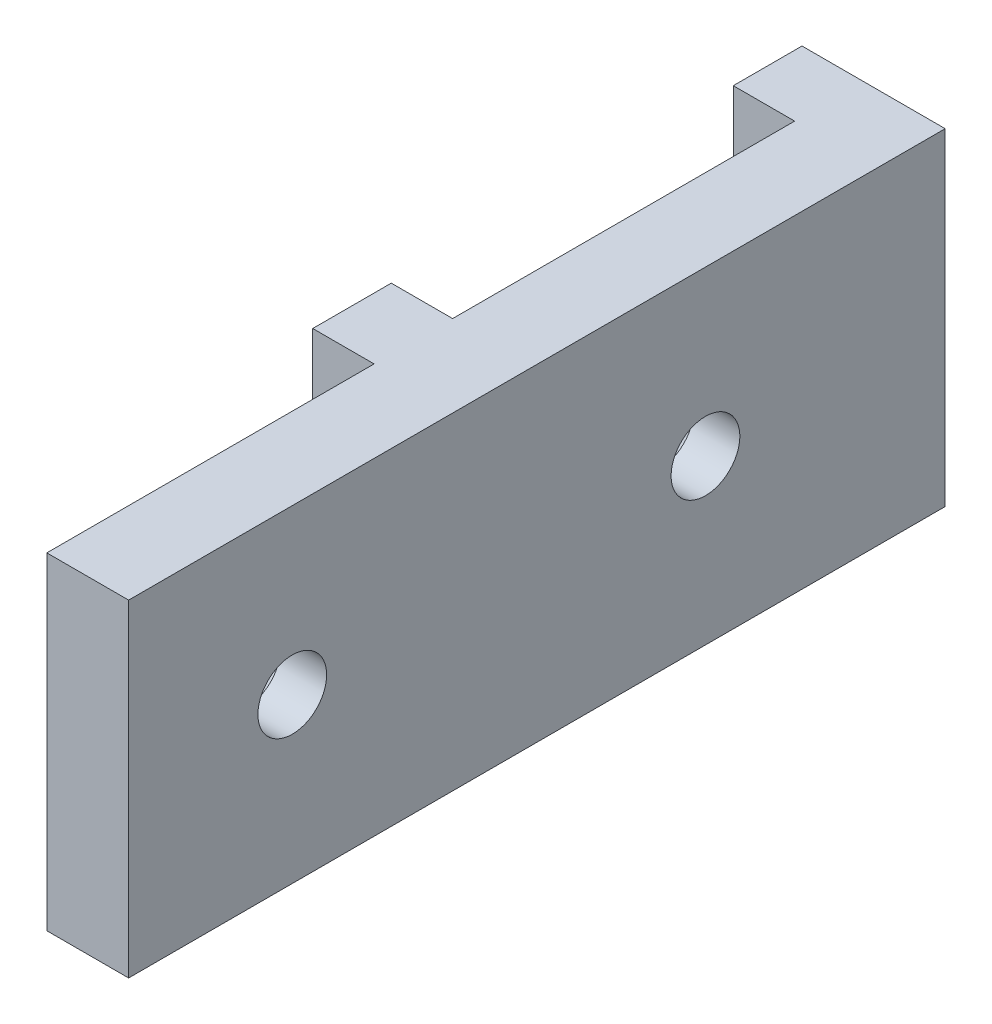
ISO-10303-21;
HEADER;
FILE_DESCRIPTION(('STEP AP214'),'2;1');
FILE_NAME('part.step','',(''),(''),'','','');
FILE_SCHEMA(('AUTOMOTIVE_DESIGN { 1 0 10303 214 1 1 1 1 }'));
ENDSEC;
DATA;
#1=APPLICATION_CONTEXT('core data for automotive mechanical design processes');
#2=APPLICATION_PROTOCOL_DEFINITION('international standard','automotive_design',2000,#1);
#3=PRODUCT_CONTEXT('',#1,'mechanical');
#4=PRODUCT('Part','Part','',(#3));
#5=PRODUCT_RELATED_PRODUCT_CATEGORY('part','',(#4));
#6=PRODUCT_DEFINITION_FORMATION('','',#4);
#7=PRODUCT_DEFINITION_CONTEXT('part definition',#1,'design');
#8=PRODUCT_DEFINITION('design','',#6,#7);
#9=PRODUCT_DEFINITION_SHAPE('','',#8);
#10=(LENGTH_UNIT() NAMED_UNIT(*) SI_UNIT(.MILLI.,.METRE.));
#11=(NAMED_UNIT(*) PLANE_ANGLE_UNIT() SI_UNIT($,.RADIAN.));
#12=(NAMED_UNIT(*) SI_UNIT($,.STERADIAN.) SOLID_ANGLE_UNIT());
#13=UNCERTAINTY_MEASURE_WITH_UNIT(LENGTH_MEASURE(1.E-05),#10,'distance_accuracy_value','');
#14=(GEOMETRIC_REPRESENTATION_CONTEXT(3) GLOBAL_UNCERTAINTY_ASSIGNED_CONTEXT((#13)) GLOBAL_UNIT_ASSIGNED_CONTEXT((#10,
#11,#12)) REPRESENTATION_CONTEXT('',''));
#15=CARTESIAN_POINT('',(0.,0.,0.));
#16=DIRECTION('',(0.,0.,1.));
#17=DIRECTION('',(1.,0.,0.));
#18=AXIS2_PLACEMENT_3D('',#15,#16,#17);
#19=CARTESIAN_POINT('',(4.7625,0.,0.));
#20=DIRECTION('',(-1.,0.,0.));
#21=DIRECTION('',(0.,0.,1.));
#22=AXIS2_PLACEMENT_3D('',#19,#20,#21);
#23=PLANE('',#22);
#24=CARTESIAN_POINT('',(4.7625,12.7,-19.3675));
#25=DIRECTION('',(-1.,0.,0.));
#26=DIRECTION('',(0.,0.,1.));
#27=AXIS2_PLACEMENT_3D('',#24,#25,#26);
#28=CIRCLE('',#27,4.7625);
#29=CARTESIAN_POINT('',(4.7625,12.7,-14.605));
#30=VERTEX_POINT('',#29);
#31=EDGE_CURVE('E213',#30,#30,#28,.T.);
#32=ORIENTED_EDGE('',*,*,#31,.F.);
#33=EDGE_LOOP('',(#32));
#34=FACE_BOUND('',#33,.T.);
#35=DIRECTION('',(0.,0.,1.));
#36=VECTOR('',#35,1.);
#37=CARTESIAN_POINT('',(4.7625,25.4,31.877));
#38=LINE('',#37,#36);
#39=CARTESIAN_POINT('',(4.7625,25.4,-32.639));
#40=VERTEX_POINT('',#39);
#41=CARTESIAN_POINT('',(4.7625,25.4,-6.096));
#42=VERTEX_POINT('',#41);
#43=EDGE_CURVE('E160',#40,#42,#38,.T.);
#44=ORIENTED_EDGE('',*,*,#43,.F.);
#45=DIRECTION('',(0.,1.,0.));
#46=VECTOR('',#45,1.);
#47=CARTESIAN_POINT('',(4.7625,25.4,-32.639));
#48=LINE('',#47,#46);
#49=CARTESIAN_POINT('',(4.7625,0.,-32.639));
#50=VERTEX_POINT('',#49);
#51=EDGE_CURVE('E239',#50,#40,#48,.T.);
#52=ORIENTED_EDGE('',*,*,#51,.F.);
#53=DIRECTION('',(0.,0.,-1.));
#54=VECTOR('',#53,1.);
#55=CARTESIAN_POINT('',(4.7625,0.,31.877));
#56=LINE('',#55,#54);
#57=CARTESIAN_POINT('',(4.7625,0.,-6.096));
#58=VERTEX_POINT('',#57);
#59=EDGE_CURVE('E166',#58,#50,#56,.T.);
#60=ORIENTED_EDGE('',*,*,#59,.F.);
#61=DIRECTION('',(0.,1.,0.));
#62=VECTOR('',#61,1.);
#63=CARTESIAN_POINT('',(4.7625,0.,-6.096));
#64=LINE('',#63,#62);
#65=EDGE_CURVE('E186',#58,#42,#64,.T.);
#66=ORIENTED_EDGE('',*,*,#65,.T.);
#67=EDGE_LOOP('',(#44,#52,#60,#66));
#68=FACE_BOUND('',#67,.T.);
#69=ADVANCED_FACE('F38',(#34,#68),#23,.T.);
#70=CARTESIAN_POINT('',(4.7625,0.,0.));
#71=DIRECTION('',(0.,0.,-1.));
#72=DIRECTION('',(-1.,0.,0.));
#73=AXIS2_PLACEMENT_3D('',#70,#71,#72);
#74=PLANE('',#73);
#75=DIRECTION('',(0.,-1.,0.));
#76=VECTOR('',#75,1.);
#77=CARTESIAN_POINT('',(0.,0.,0.));
#78=LINE('',#77,#76);
#79=CARTESIAN_POINT('',(0.,25.4,0.));
#80=VERTEX_POINT('',#79);
#81=CARTESIAN_POINT('',(0.,0.,0.));
#82=VERTEX_POINT('',#81);
#83=EDGE_CURVE('E182',#80,#82,#78,.T.);
#84=ORIENTED_EDGE('',*,*,#83,.T.);
#85=DIRECTION('',(-1.,0.,0.));
#86=VECTOR('',#85,1.);
#87=CARTESIAN_POINT('',(4.7625,0.,0.));
#88=LINE('',#87,#86);
#89=CARTESIAN_POINT('',(4.7625,0.,0.));
#90=VERTEX_POINT('',#89);
#91=EDGE_CURVE('E11',#90,#82,#88,.T.);
#92=ORIENTED_EDGE('',*,*,#91,.F.);
#93=DIRECTION('',(0.,-1.,0.));
#94=VECTOR('',#93,1.);
#95=CARTESIAN_POINT('',(4.7625,0.,0.));
#96=LINE('',#95,#94);
#97=CARTESIAN_POINT('',(4.7625,25.4,0.));
#98=VERTEX_POINT('',#97);
#99=EDGE_CURVE('E183',#98,#90,#96,.T.);
#100=ORIENTED_EDGE('',*,*,#99,.F.);
#101=DIRECTION('',(-1.,0.,0.));
#102=VECTOR('',#101,1.);
#103=CARTESIAN_POINT('',(4.7625,25.4,0.));
#104=LINE('',#103,#102);
#105=EDGE_CURVE('E157',#98,#80,#104,.T.);
#106=ORIENTED_EDGE('',*,*,#105,.T.);
#107=EDGE_LOOP('',(#84,#92,#100,#106));
#108=FACE_BOUND('',#107,.T.);
#109=ADVANCED_FACE('F40',(#108),#74,.F.);
#110=CARTESIAN_POINT('',(4.7625,0.,0.));
#111=DIRECTION('',(0.,1.,0.));
#112=DIRECTION('',(0.,0.,1.));
#113=AXIS2_PLACEMENT_3D('',#110,#111,#112);
#114=PLANE('',#113);
#115=DIRECTION('',(0.,0.,-1.));
#116=VECTOR('',#115,1.);
#117=CARTESIAN_POINT('',(11.1125,0.,31.877));
#118=LINE('',#117,#116);
#119=CARTESIAN_POINT('',(11.1125,0.,25.4));
#120=VERTEX_POINT('',#119);
#121=CARTESIAN_POINT('',(11.1125,0.,-37.973));
#122=VERTEX_POINT('',#121);
#123=EDGE_CURVE('E171',#120,#122,#118,.T.);
#124=ORIENTED_EDGE('',*,*,#123,.F.);
#125=DIRECTION('',(-1.,0.,0.));
#126=VECTOR('',#125,1.);
#127=CARTESIAN_POINT('',(11.1135,0.,25.4));
#128=LINE('',#127,#126);
#129=CARTESIAN_POINT('',(4.7625,0.,25.4));
#130=VERTEX_POINT('',#129);
#131=EDGE_CURVE('E59',#120,#130,#128,.T.);
#132=ORIENTED_EDGE('',*,*,#131,.T.);
#133=EDGE_CURVE('E152',#130,#90,#56,.T.);
#134=ORIENTED_EDGE('',*,*,#133,.T.);
#135=ORIENTED_EDGE('',*,*,#91,.T.);
#136=DIRECTION('',(0.,0.,-1.));
#137=VECTOR('',#136,1.);
#138=CARTESIAN_POINT('',(0.,0.,0.));
#139=LINE('',#138,#137);
#140=CARTESIAN_POINT('',(0.,0.,-6.096));
#141=VERTEX_POINT('',#140);
#142=EDGE_CURVE('E194',#82,#141,#139,.T.);
#143=ORIENTED_EDGE('',*,*,#142,.T.);
#144=DIRECTION('',(-1.,0.,0.));
#145=VECTOR('',#144,1.);
#146=CARTESIAN_POINT('',(4.7625,0.,-6.096));
#147=LINE('',#146,#145);
#148=EDGE_CURVE('E48',#58,#141,#147,.T.);
#149=ORIENTED_EDGE('',*,*,#148,.F.);
#150=ORIENTED_EDGE('',*,*,#59,.T.);
#151=DIRECTION('',(1.,0.,0.));
#152=VECTOR('',#151,1.);
#153=CARTESIAN_POINT('',(0.,0.,-32.639));
#154=LINE('',#153,#152);
#155=CARTESIAN_POINT('',(0.,0.,-32.639));
#156=VERTEX_POINT('',#155);
#157=EDGE_CURVE('E161',#156,#50,#154,.T.);
#158=ORIENTED_EDGE('',*,*,#157,.F.);
#159=DIRECTION('',(0.,0.,1.));
#160=VECTOR('',#159,1.);
#161=CARTESIAN_POINT('',(0.,0.,-37.973));
#162=LINE('',#161,#160);
#163=CARTESIAN_POINT('',(0.,0.,-37.973));
#164=VERTEX_POINT('',#163);
#165=EDGE_CURVE('E245',#164,#156,#162,.T.);
#166=ORIENTED_EDGE('',*,*,#165,.F.);
#167=DIRECTION('',(-1.,0.,0.));
#168=VECTOR('',#167,1.);
#169=CARTESIAN_POINT('',(11.1125,0.,-37.973));
#170=LINE('',#169,#168);
#171=EDGE_CURVE('E176',#122,#164,#170,.T.);
#172=ORIENTED_EDGE('',*,*,#171,.F.);
#173=EDGE_LOOP('',(#124,#132,#134,#135,#143,#149,#150,#158,#166,#172));
#174=FACE_BOUND('',#173,.T.);
#175=ADVANCED_FACE('F271',(#174),#114,.F.);
#176=CARTESIAN_POINT('',(4.7625,0.,-6.096));
#177=DIRECTION('',(0.,0.,1.));
#178=DIRECTION('',(1.,0.,0.));
#179=AXIS2_PLACEMENT_3D('',#176,#177,#178);
#180=PLANE('',#179);
#181=DIRECTION('',(0.,1.,0.));
#182=VECTOR('',#181,1.);
#183=CARTESIAN_POINT('',(0.,0.,-6.096));
#184=LINE('',#183,#182);
#185=CARTESIAN_POINT('',(0.,25.4,-6.096));
#186=VERTEX_POINT('',#185);
#187=EDGE_CURVE('E197',#141,#186,#184,.T.);
#188=ORIENTED_EDGE('',*,*,#187,.T.);
#189=DIRECTION('',(-1.,0.,0.));
#190=VECTOR('',#189,1.);
#191=CARTESIAN_POINT('',(4.7625,25.4,-6.096));
#192=LINE('',#191,#190);
#193=EDGE_CURVE('E204',#42,#186,#192,.T.);
#194=ORIENTED_EDGE('',*,*,#193,.F.);
#195=ORIENTED_EDGE('',*,*,#65,.F.);
#196=ORIENTED_EDGE('',*,*,#148,.T.);
#197=EDGE_LOOP('',(#188,#194,#195,#196));
#198=FACE_BOUND('',#197,.T.);
#199=ADVANCED_FACE('F290',(#198),#180,.F.);
#200=CARTESIAN_POINT('',(4.7625,25.4,0.));
#201=DIRECTION('',(0.,-1.,0.));
#202=DIRECTION('',(0.,0.,-1.));
#203=AXIS2_PLACEMENT_3D('',#200,#201,#202);
#204=PLANE('',#203);
#205=CARTESIAN_POINT('',(4.7625,25.4,25.4));
#206=VERTEX_POINT('',#205);
#207=EDGE_CURVE('E151',#98,#206,#38,.T.);
#208=ORIENTED_EDGE('',*,*,#207,.T.);
#209=DIRECTION('',(-1.,0.,0.));
#210=VECTOR('',#209,1.);
#211=CARTESIAN_POINT('',(11.1135,25.4,25.4));
#212=LINE('',#211,#210);
#213=CARTESIAN_POINT('',(11.1125,25.4,25.4));
#214=VERTEX_POINT('',#213);
#215=EDGE_CURVE('E137',#214,#206,#212,.T.);
#216=ORIENTED_EDGE('',*,*,#215,.F.);
#217=DIRECTION('',(0.,0.,1.));
#218=VECTOR('',#217,1.);
#219=CARTESIAN_POINT('',(11.1125,25.4,31.877));
#220=LINE('',#219,#218);
#221=CARTESIAN_POINT('',(11.1125,25.4,-37.973));
#222=VERTEX_POINT('',#221);
#223=EDGE_CURVE('E260',#222,#214,#220,.T.);
#224=ORIENTED_EDGE('',*,*,#223,.F.);
#225=DIRECTION('',(-1.,0.,0.));
#226=VECTOR('',#225,1.);
#227=CARTESIAN_POINT('',(11.1125,25.4,-37.973));
#228=LINE('',#227,#226);
#229=CARTESIAN_POINT('',(0.,25.4,-37.973));
#230=VERTEX_POINT('',#229);
#231=EDGE_CURVE('E179',#222,#230,#228,.T.);
#232=ORIENTED_EDGE('',*,*,#231,.T.);
#233=DIRECTION('',(0.,0.,-1.));
#234=VECTOR('',#233,1.);
#235=CARTESIAN_POINT('',(0.,25.4,-37.973));
#236=LINE('',#235,#234);
#237=CARTESIAN_POINT('',(0.,25.4,-32.639));
#238=VERTEX_POINT('',#237);
#239=EDGE_CURVE('E251',#238,#230,#236,.T.);
#240=ORIENTED_EDGE('',*,*,#239,.F.);
#241=DIRECTION('',(1.,0.,0.));
#242=VECTOR('',#241,1.);
#243=CARTESIAN_POINT('',(0.,25.4,-32.639));
#244=LINE('',#243,#242);
#245=EDGE_CURVE('E70',#238,#40,#244,.T.);
#246=ORIENTED_EDGE('',*,*,#245,.T.);
#247=ORIENTED_EDGE('',*,*,#43,.T.);
#248=ORIENTED_EDGE('',*,*,#193,.T.);
#249=DIRECTION('',(0.,0.,1.));
#250=VECTOR('',#249,1.);
#251=CARTESIAN_POINT('',(0.,25.4,0.));
#252=LINE('',#251,#250);
#253=EDGE_CURVE('E187',#186,#80,#252,.T.);
#254=ORIENTED_EDGE('',*,*,#253,.T.);
#255=ORIENTED_EDGE('',*,*,#105,.F.);
#256=EDGE_LOOP('',(#208,#216,#224,#232,#240,#246,#247,#248,#254,#255));
#257=FACE_BOUND('',#256,.T.);
#258=ADVANCED_FACE('F155',(#257),#204,.F.);
#259=CARTESIAN_POINT('',(0.,0.,0.));
#260=DIRECTION('',(-1.,0.,0.));
#261=DIRECTION('',(0.,0.,1.));
#262=AXIS2_PLACEMENT_3D('',#259,#260,#261);
#263=PLANE('',#262);
#264=ORIENTED_EDGE('',*,*,#83,.F.);
#265=ORIENTED_EDGE('',*,*,#253,.F.);
#266=ORIENTED_EDGE('',*,*,#187,.F.);
#267=ORIENTED_EDGE('',*,*,#142,.F.);
#268=EDGE_LOOP('',(#264,#265,#266,#267));
#269=FACE_BOUND('',#268,.T.);
#270=ADVANCED_FACE('F294',(#269),#263,.T.);
#271=CARTESIAN_POINT('',(4.7625,12.7,12.7));
#272=DIRECTION('',(-1.,0.,0.));
#273=DIRECTION('',(0.,0.,1.));
#274=AXIS2_PLACEMENT_3D('',#271,#272,#273);
#275=CIRCLE('',#274,4.7625);
#276=CARTESIAN_POINT('',(4.7625,12.7,17.4625));
#277=VERTEX_POINT('',#276);
#278=EDGE_CURVE('E222',#277,#277,#275,.T.);
#279=ORIENTED_EDGE('',*,*,#278,.F.);
#280=EDGE_LOOP('',(#279));
#281=FACE_BOUND('',#280,.T.);
#282=DIRECTION('',(0.,-1.,0.));
#283=VECTOR('',#282,1.);
#284=CARTESIAN_POINT('',(4.7625,25.4,25.4));
#285=LINE('',#284,#283);
#286=EDGE_CURVE('E140',#206,#130,#285,.T.);
#287=ORIENTED_EDGE('',*,*,#286,.F.);
#288=ORIENTED_EDGE('',*,*,#207,.F.);
#289=ORIENTED_EDGE('',*,*,#99,.T.);
#290=ORIENTED_EDGE('',*,*,#133,.F.);
#291=EDGE_LOOP('',(#287,#288,#289,#290));
#292=FACE_BOUND('',#291,.T.);
#293=ADVANCED_FACE('F149',(#281,#292),#23,.T.);
#294=CARTESIAN_POINT('',(11.1125,0.,-37.973));
#295=DIRECTION('',(0.,0.,1.));
#296=DIRECTION('',(1.,0.,0.));
#297=AXIS2_PLACEMENT_3D('',#294,#295,#296);
#298=PLANE('',#297);
#299=ORIENTED_EDGE('',*,*,#171,.T.);
#300=DIRECTION('',(0.,-1.,0.));
#301=VECTOR('',#300,1.);
#302=CARTESIAN_POINT('',(0.,25.4,-37.973));
#303=LINE('',#302,#301);
#304=EDGE_CURVE('E241',#230,#164,#303,.T.);
#305=ORIENTED_EDGE('',*,*,#304,.F.);
#306=ORIENTED_EDGE('',*,*,#231,.F.);
#307=DIRECTION('',(0.,1.,0.));
#308=VECTOR('',#307,1.);
#309=CARTESIAN_POINT('',(11.1125,0.,-37.973));
#310=LINE('',#309,#308);
#311=EDGE_CURVE('E175',#122,#222,#310,.T.);
#312=ORIENTED_EDGE('',*,*,#311,.F.);
#313=EDGE_LOOP('',(#299,#305,#306,#312));
#314=FACE_BOUND('',#313,.T.);
#315=ADVANCED_FACE('F275',(#314),#298,.F.);
#316=CARTESIAN_POINT('',(11.1125,0.,0.));
#317=DIRECTION('',(-1.,0.,0.));
#318=DIRECTION('',(0.,0.,1.));
#319=AXIS2_PLACEMENT_3D('',#316,#317,#318);
#320=PLANE('',#319);
#321=CARTESIAN_POINT('',(11.1125,12.7,-19.3675));
#322=DIRECTION('',(-1.,0.,0.));
#323=DIRECTION('',(0.,0.,1.));
#324=AXIS2_PLACEMENT_3D('',#321,#322,#323);
#325=CIRCLE('',#324,2.667);
#326=CARTESIAN_POINT('',(11.1125,12.7,-16.7005));
#327=VERTEX_POINT('',#326);
#328=EDGE_CURVE('E230',#327,#327,#325,.F.);
#329=ORIENTED_EDGE('',*,*,#328,.F.);
#330=EDGE_LOOP('',(#329));
#331=FACE_BOUND('',#330,.T.);
#332=CARTESIAN_POINT('',(11.1125,12.7,12.7));
#333=DIRECTION('',(-1.,0.,0.));
#334=DIRECTION('',(0.,0.,1.));
#335=AXIS2_PLACEMENT_3D('',#332,#333,#334);
#336=CIRCLE('',#335,2.667);
#337=CARTESIAN_POINT('',(11.1125,12.7,15.367));
#338=VERTEX_POINT('',#337);
#339=EDGE_CURVE('E220',#338,#338,#336,.F.);
#340=ORIENTED_EDGE('',*,*,#339,.F.);
#341=EDGE_LOOP('',(#340));
#342=FACE_BOUND('',#341,.T.);
#343=ORIENTED_EDGE('',*,*,#223,.T.);
#344=DIRECTION('',(0.,1.,0.));
#345=VECTOR('',#344,1.);
#346=CARTESIAN_POINT('',(11.1125,25.4,25.4));
#347=LINE('',#346,#345);
#348=EDGE_CURVE('E141',#120,#214,#347,.T.);
#349=ORIENTED_EDGE('',*,*,#348,.F.);
#350=ORIENTED_EDGE('',*,*,#123,.T.);
#351=ORIENTED_EDGE('',*,*,#311,.T.);
#352=EDGE_LOOP('',(#343,#349,#350,#351));
#353=FACE_BOUND('',#352,.T.);
#354=ADVANCED_FACE('F266',(#331,#342,#353),#320,.F.);
#355=CARTESIAN_POINT('',(0.,25.4,-32.639));
#356=DIRECTION('',(0.,0.,-1.));
#357=DIRECTION('',(-1.,0.,0.));
#358=AXIS2_PLACEMENT_3D('',#355,#356,#357);
#359=PLANE('',#358);
#360=ORIENTED_EDGE('',*,*,#51,.T.);
#361=ORIENTED_EDGE('',*,*,#245,.F.);
#362=DIRECTION('',(0.,1.,0.));
#363=VECTOR('',#362,1.);
#364=CARTESIAN_POINT('',(0.,25.4,-32.639));
#365=LINE('',#364,#363);
#366=EDGE_CURVE('E248',#156,#238,#365,.T.);
#367=ORIENTED_EDGE('',*,*,#366,.F.);
#368=ORIENTED_EDGE('',*,*,#157,.T.);
#369=EDGE_LOOP('',(#360,#361,#367,#368));
#370=FACE_BOUND('',#369,.T.);
#371=ADVANCED_FACE('F280',(#370),#359,.F.);
#372=CARTESIAN_POINT('',(0.,0.,0.));
#373=DIRECTION('',(-1.,0.,0.));
#374=DIRECTION('',(0.,0.,1.));
#375=AXIS2_PLACEMENT_3D('',#372,#373,#374);
#376=PLANE('',#375);
#377=ORIENTED_EDGE('',*,*,#304,.T.);
#378=ORIENTED_EDGE('',*,*,#165,.T.);
#379=ORIENTED_EDGE('',*,*,#366,.T.);
#380=ORIENTED_EDGE('',*,*,#239,.T.);
#381=EDGE_LOOP('',(#377,#378,#379,#380));
#382=FACE_BOUND('',#381,.T.);
#383=ADVANCED_FACE('F277',(#382),#376,.T.);
#384=CARTESIAN_POINT('',(11.1135,25.4,25.4));
#385=DIRECTION('',(0.,0.,-1.));
#386=DIRECTION('',(0.,1.,0.));
#387=AXIS2_PLACEMENT_3D('',#384,#385,#386);
#388=PLANE('',#387);
#389=ORIENTED_EDGE('',*,*,#348,.T.);
#390=ORIENTED_EDGE('',*,*,#215,.T.);
#391=ORIENTED_EDGE('',*,*,#286,.T.);
#392=ORIENTED_EDGE('',*,*,#131,.F.);
#393=EDGE_LOOP('',(#389,#390,#391,#392));
#394=FACE_BOUND('',#393,.T.);
#395=ADVANCED_FACE('F139',(#394),#388,.F.);
#396=CARTESIAN_POINT('',(11.1135,12.7,12.7));
#397=DIRECTION('',(-1.,0.,0.));
#398=DIRECTION('',(0.,0.,1.));
#399=AXIS2_PLACEMENT_3D('',#396,#397,#398);
#400=CYLINDRICAL_SURFACE('',#399,2.667);
#401=CARTESIAN_POINT('',(7.54332242370557,12.7,12.7));
#402=DIRECTION('',(-1.,0.,0.));
#403=DIRECTION('',(0.,0.,1.));
#404=AXIS2_PLACEMENT_3D('',#401,#402,#403);
#405=CIRCLE('',#404,2.667);
#406=CARTESIAN_POINT('',(7.54332242370557,12.7,15.367));
#407=VERTEX_POINT('',#406);
#408=EDGE_CURVE('E42',#407,#407,#405,.T.);
#409=ORIENTED_EDGE('',*,*,#408,.T.);
#410=EDGE_LOOP('',(#409));
#411=FACE_BOUND('',#410,.T.);
#412=ORIENTED_EDGE('',*,*,#339,.T.);
#413=EDGE_LOOP('',(#412));
#414=FACE_BOUND('',#413,.T.);
#415=ADVANCED_FACE('F324',(#411,#414),#400,.F.);
#416=CARTESIAN_POINT('',(11.1135,12.7,-19.3675));
#417=DIRECTION('',(-1.,0.,0.));
#418=DIRECTION('',(0.,0.,1.));
#419=AXIS2_PLACEMENT_3D('',#416,#417,#418);
#420=CYLINDRICAL_SURFACE('',#419,2.667);
#421=CARTESIAN_POINT('',(7.54332242370557,12.7,-19.3675));
#422=DIRECTION('',(-1.,0.,0.));
#423=DIRECTION('',(0.,0.,1.));
#424=AXIS2_PLACEMENT_3D('',#421,#422,#423);
#425=CIRCLE('',#424,2.667);
#426=CARTESIAN_POINT('',(7.54332242370557,12.7,-16.7005));
#427=VERTEX_POINT('',#426);
#428=EDGE_CURVE('E210',#427,#427,#425,.T.);
#429=ORIENTED_EDGE('',*,*,#428,.T.);
#430=EDGE_LOOP('',(#429));
#431=FACE_BOUND('',#430,.T.);
#432=ORIENTED_EDGE('',*,*,#328,.T.);
#433=EDGE_LOOP('',(#432));
#434=FACE_BOUND('',#433,.T.);
#435=ADVANCED_FACE('F327',(#431,#434),#420,.F.);
#436=CARTESIAN_POINT('',(4.7625,12.7,-19.3675));
#437=DIRECTION('',(-1.,0.,0.));
#438=DIRECTION('',(0.,0.,1.));
#439=AXIS2_PLACEMENT_3D('',#436,#437,#438);
#440=CONICAL_SURFACE('',#439,4.7625,0.645771823237902);
#441=ORIENTED_EDGE('',*,*,#31,.T.);
#442=EDGE_LOOP('',(#441));
#443=FACE_BOUND('',#442,.T.);
#444=ORIENTED_EDGE('',*,*,#428,.F.);
#445=EDGE_LOOP('',(#444));
#446=FACE_BOUND('',#445,.T.);
#447=ADVANCED_FACE('F320',(#443,#446),#440,.F.);
#448=CARTESIAN_POINT('',(4.7625,12.7,12.7));
#449=DIRECTION('',(-1.,0.,0.));
#450=DIRECTION('',(0.,0.,1.));
#451=AXIS2_PLACEMENT_3D('',#448,#449,#450);
#452=CONICAL_SURFACE('',#451,4.7625,0.645771823237902);
#453=ORIENTED_EDGE('',*,*,#278,.T.);
#454=EDGE_LOOP('',(#453));
#455=FACE_BOUND('',#454,.T.);
#456=ORIENTED_EDGE('',*,*,#408,.F.);
#457=EDGE_LOOP('',(#456));
#458=FACE_BOUND('',#457,.T.);
#459=ADVANCED_FACE('F317',(#455,#458),#452,.F.);
#460=CLOSED_SHELL('',(#69,#109,#175,#199,#258,#270,#293,#315,#354,#371,#383,#395,#415,#435,#447,#459));
#461=MANIFOLD_SOLID_BREP('B2',#460);
#462=ADVANCED_BREP_SHAPE_REPRESENTATION('',(#18,#461),#14);
#463=SHAPE_DEFINITION_REPRESENTATION(#9,#462);
ENDSEC;
END-ISO-10303-21;
